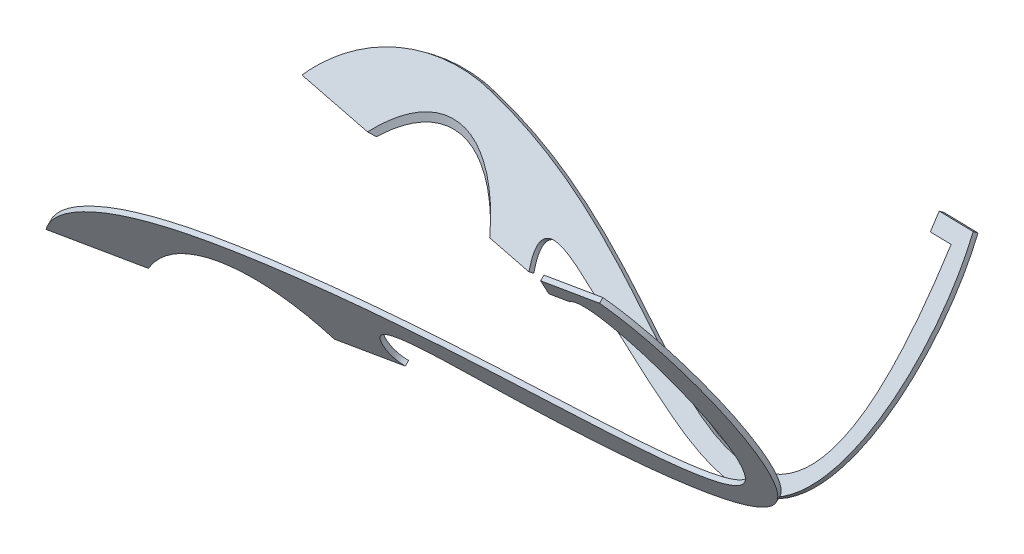
ISO-10303-21;
HEADER;
FILE_DESCRIPTION(('STEP AP214'),'2;1');
FILE_NAME('part.step','',(''),(''),'','','');
FILE_SCHEMA(('AUTOMOTIVE_DESIGN { 1 0 10303 214 1 1 1 1 }'));
ENDSEC;
DATA;
#1=APPLICATION_CONTEXT('core data for automotive mechanical design processes');
#2=APPLICATION_PROTOCOL_DEFINITION('international standard','automotive_design',2000,#1);
#3=PRODUCT_CONTEXT('',#1,'mechanical');
#4=PRODUCT('Part','Part','',(#3));
#5=PRODUCT_RELATED_PRODUCT_CATEGORY('part','',(#4));
#6=PRODUCT_DEFINITION_FORMATION('','',#4);
#7=PRODUCT_DEFINITION_CONTEXT('part definition',#1,'design');
#8=PRODUCT_DEFINITION('design','',#6,#7);
#9=PRODUCT_DEFINITION_SHAPE('','',#8);
#10=(LENGTH_UNIT() NAMED_UNIT(*) SI_UNIT(.MILLI.,.METRE.));
#11=(NAMED_UNIT(*) PLANE_ANGLE_UNIT() SI_UNIT($,.RADIAN.));
#12=(NAMED_UNIT(*) SI_UNIT($,.STERADIAN.) SOLID_ANGLE_UNIT());
#13=UNCERTAINTY_MEASURE_WITH_UNIT(LENGTH_MEASURE(1.E-05),#10,'distance_accuracy_value','');
#14=(GEOMETRIC_REPRESENTATION_CONTEXT(3) GLOBAL_UNCERTAINTY_ASSIGNED_CONTEXT((#13)) GLOBAL_UNIT_ASSIGNED_CONTEXT((#10,
#11,#12)) REPRESENTATION_CONTEXT('',''));
#15=CARTESIAN_POINT('',(0.,0.,0.));
#16=DIRECTION('',(0.,0.,1.));
#17=DIRECTION('',(1.,0.,0.));
#18=AXIS2_PLACEMENT_3D('',#15,#16,#17);
#19=CARTESIAN_POINT('',(-126.890243985277,-4.70312074669387,222.992271828305));
#20=DIRECTION('',(0.0946498601323054,0.882500171342859,0.46068953923088));
#21=DIRECTION('',(0.,-0.462767074283753,0.886479912326758));
#22=AXIS2_PLACEMENT_3D('',#19,#20,#21);
#23=PLANE('',#22);
#24=DIRECTION('',(0.979540105481506,0.,-0.201249054043191));
#25=VECTOR('',#24,1.);
#26=CARTESIAN_POINT('',(-128.666267232034,0.,214.347828719058));
#27=LINE('',#26,#25);
#28=CARTESIAN_POINT('',(-290.690687625136,0.,247.636165922954));
#29=VERTEX_POINT('',#28);
#30=CARTESIAN_POINT('',(-128.666267232034,0.,214.347828719058));
#31=VERTEX_POINT('',#30);
#32=EDGE_CURVE('E94',#29,#31,#27,.T.);
#33=ORIENTED_EDGE('',*,*,#32,.T.);
#34=CARTESIAN_POINT('',(0.,98.095797668499,0.));
#35=DIRECTION('',(0.0946498601323054,0.882500171342859,0.46068953923088));
#36=DIRECTION('',(-0.177602324675704,0.47031207466939,-0.864444310924631));
#37=AXIS2_PLACEMENT_3D('',#34,#35,#36);
#38=ELLIPSE('',#37,283.28606397842,250.);
#39=CARTESIAN_POINT('',(-116.961656442491,-4.70312074669387,220.952417778645));
#40=VERTEX_POINT('',#39);
#41=EDGE_CURVE('E59',#31,#40,#38,.T.);
#42=ORIENTED_EDGE('',*,*,#41,.T.);
#43=DIRECTION('',(0.979540105481506,0.,-0.201249054043191));
#44=VECTOR('',#43,1.);
#45=CARTESIAN_POINT('',(-126.890243985277,-4.70312074669387,222.992271828305));
#46=LINE('',#45,#44);
#47=CARTESIAN_POINT('',(-288.914664378379,-4.70312074669394,256.2806090322));
#48=VERTEX_POINT('',#47);
#49=EDGE_CURVE('E172',#48,#40,#46,.T.);
#50=ORIENTED_EDGE('',*,*,#49,.F.);
#51=DIRECTION('',(-0.177602324675705,0.47031207466939,-0.864444310924631));
#52=VECTOR('',#51,1.);
#53=CARTESIAN_POINT('',(-288.914664378379,-4.70312074669394,256.2806090322));
#54=LINE('',#53,#52);
#55=EDGE_CURVE('E137',#48,#29,#54,.T.);
#56=ORIENTED_EDGE('',*,*,#55,.T.);
#57=EDGE_LOOP('',(#33,#42,#50,#56));
#58=FACE_BOUND('',#57,.T.);
#59=ADVANCED_FACE('F44',(#58),#23,.F.);
#60=CARTESIAN_POINT('',(194.600857594281,-4.70312074669379,156.941091571233));
#61=VERTEX_POINT('',#60);
#62=CARTESIAN_POINT('',(313.599347392111,-4.70312074669383,132.492543349096));
#63=VERTEX_POINT('',#62);
#64=EDGE_CURVE('E102',#61,#63,#46,.T.);
#65=ORIENTED_EDGE('',*,*,#64,.F.);
#66=CARTESIAN_POINT('',(202.753421890311,0.,146.256794412327));
#67=VERTEX_POINT('',#66);
#68=EDGE_CURVE('E180',#61,#67,#38,.T.);
#69=ORIENTED_EDGE('',*,*,#68,.T.);
#70=CARTESIAN_POINT('',(311.823324145354,0.,123.84810023985));
#71=VERTEX_POINT('',#70);
#72=EDGE_CURVE('E179',#67,#71,#27,.T.);
#73=ORIENTED_EDGE('',*,*,#72,.T.);
#74=DIRECTION('',(-0.177602324675705,0.47031207466939,-0.864444310924631));
#75=VECTOR('',#74,1.);
#76=CARTESIAN_POINT('',(313.599347392111,-4.70312074669383,132.492543349096));
#77=LINE('',#76,#75);
#78=EDGE_CURVE('E52',#63,#71,#77,.T.);
#79=ORIENTED_EDGE('',*,*,#78,.F.);
#80=EDGE_LOOP('',(#65,#69,#73,#79));
#81=FACE_BOUND('',#80,.T.);
#82=ADVANCED_FACE('F46',(#81),#23,.F.);
#83=CARTESIAN_POINT('',(313.599347392111,-4.70312074669385,132.492543349096));
#84=CARTESIAN_POINT('',(292.760489072689,5.13202945054136,142.124881106236));
#85=CARTESIAN_POINT('',(283.884343089574,114.718767101645,203.570586087379));
#86=CARTESIAN_POINT('',(605.809475240874,-29.1290002950087,59.1680003048838));
#87=CARTESIAN_POINT('',(1087.13537008227,-117.314227495178,-87.6999626230578));
#88=CARTESIAN_POINT('',(933.765188382121,352.555347713641,199.4489403304));
#89=CARTESIAN_POINT('',(836.303003600073,431.884725446082,262.632969791383));
#90=B_SPLINE_CURVE_WITH_KNOTS('',3,(#83,#84,#85,#86,#87,#88,#89),.UNSPECIFIED.,.F.,.F.,(4,1,1,1,
4),(0.,0.0586117794744246,0.210635662863056,0.589849873863333,1.),.UNSPECIFIED.);
#91=DIRECTION('',(-0.177602324675705,0.47031207466939,-0.864444310924631));
#92=VECTOR('',#91,1.);
#93=SURFACE_OF_LINEAR_EXTRUSION('',#90,#92);
#94=CARTESIAN_POINT('',(311.823324145354,0.,123.84810023985));
#95=CARTESIAN_POINT('',(290.984465825932,9.83515019723526,133.48043799699));
#96=CARTESIAN_POINT('',(282.108319842817,119.421887848339,194.926142978133));
#97=CARTESIAN_POINT('',(604.033451994117,-24.4258795483148,50.5235571956375));
#98=CARTESIAN_POINT('',(1085.35934683551,-112.611106748484,-96.3444057323042));
#99=CARTESIAN_POINT('',(931.989165135364,357.258468460335,190.804497221154));
#100=CARTESIAN_POINT('',(834.526980353316,436.587846192776,253.988526682137));
#101=B_SPLINE_CURVE_WITH_KNOTS('',3,(#94,#95,#96,#97,#98,#99,#100),.UNSPECIFIED.,.F.,.F.,(4,1,1,
1,4),(0.,0.0586117794744246,0.210635662863056,0.589849873863333,1.),.UNSPECIFIED.);
#102=CARTESIAN_POINT('',(834.526980353316,436.587846192776,253.988526682137));
#103=VERTEX_POINT('',#102);
#104=EDGE_CURVE('E210',#71,#103,#101,.T.);
#105=ORIENTED_EDGE('',*,*,#104,.T.);
#106=DIRECTION('',(-0.177602324675705,0.47031207466939,-0.864444310924631));
#107=VECTOR('',#106,1.);
#108=CARTESIAN_POINT('',(836.303003600073,431.884725446082,262.632969791383));
#109=LINE('',#108,#107);
#110=CARTESIAN_POINT('',(836.303003600073,431.884725446082,262.632969791383));
#111=VERTEX_POINT('',#110);
#112=EDGE_CURVE('E206',#111,#103,#109,.T.);
#113=ORIENTED_EDGE('',*,*,#112,.F.);
#114=EDGE_CURVE('E167',#63,#111,#90,.T.);
#115=ORIENTED_EDGE('',*,*,#114,.F.);
#116=ORIENTED_EDGE('',*,*,#78,.T.);
#117=EDGE_LOOP('',(#105,#113,#115,#116));
#118=FACE_BOUND('',#117,.T.);
#119=ADVANCED_FACE('F162',(#118),#93,.F.);
#120=CARTESIAN_POINT('',(737.48161955563,431.884725446082,282.936079329106));
#121=DIRECTION('',(-0.0946498601323044,-0.882500171342859,-0.46068953923088));
#122=DIRECTION('',(0.,0.462767074283753,-0.886479912326757));
#123=AXIS2_PLACEMENT_3D('',#120,#121,#122);
#124=PLANE('',#123);
#125=DIRECTION('',(-0.979540105481506,0.,0.201249054043191));
#126=VECTOR('',#125,1.);
#127=CARTESIAN_POINT('',(735.705596308873,436.587846192776,274.291636219859));
#128=LINE('',#127,#126);
#129=CARTESIAN_POINT('',(735.705596308873,436.587846192776,274.291636219859));
#130=VERTEX_POINT('',#129);
#131=EDGE_CURVE('E212',#103,#130,#128,.T.);
#132=ORIENTED_EDGE('',*,*,#131,.T.);
#133=DIRECTION('',(-0.177602324675705,0.47031207466939,-0.864444310924631));
#134=VECTOR('',#133,1.);
#135=CARTESIAN_POINT('',(737.48161955563,431.884725446082,282.936079329106));
#136=LINE('',#135,#134);
#137=CARTESIAN_POINT('',(737.48161955563,431.884725446082,282.936079329106));
#138=VERTEX_POINT('',#137);
#139=EDGE_CURVE('E131',#138,#130,#136,.T.);
#140=ORIENTED_EDGE('',*,*,#139,.F.);
#141=DIRECTION('',(-0.979540105481506,0.,0.201249054043191));
#142=VECTOR('',#141,1.);
#143=CARTESIAN_POINT('',(737.48161955563,431.884725446082,282.936079329106));
#144=LINE('',#143,#142);
#145=EDGE_CURVE('E119',#111,#138,#144,.T.);
#146=ORIENTED_EDGE('',*,*,#145,.F.);
#147=ORIENTED_EDGE('',*,*,#112,.T.);
#148=EDGE_LOOP('',(#132,#140,#146,#147));
#149=FACE_BOUND('',#148,.T.);
#150=ADVANCED_FACE('F160',(#149),#124,.F.);
#151=CARTESIAN_POINT('',(737.087506644061,400.296879253306,265.831275791019));
#152=DIRECTION('',(0.984041186116776,0.0750800821817315,-0.161325525833552));
#153=DIRECTION('',(-0.161782154768596,0.,-0.986826496603344));
#154=AXIS2_PLACEMENT_3D('',#151,#152,#153);
#155=PLANE('',#154);
#156=DIRECTION('',(-0.0109707928461565,-0.879300593471743,-0.476140848935026));
#157=VECTOR('',#156,1.);
#158=CARTESIAN_POINT('',(735.311483397304,405.,257.186832681773));
#159=LINE('',#158,#157);
#160=CARTESIAN_POINT('',(735.311483397304,405.,257.186832681773));
#161=VERTEX_POINT('',#160);
#162=EDGE_CURVE('E128',#130,#161,#159,.T.);
#163=ORIENTED_EDGE('',*,*,#162,.T.);
#164=DIRECTION('',(-0.177602324675705,0.47031207466939,-0.864444310924631));
#165=VECTOR('',#164,1.);
#166=CARTESIAN_POINT('',(737.087506644061,400.296879253306,265.831275791019));
#167=LINE('',#166,#165);
#168=CARTESIAN_POINT('',(737.087506644061,400.296879253306,265.831275791019));
#169=VERTEX_POINT('',#168);
#170=EDGE_CURVE('E125',#169,#161,#167,.T.);
#171=ORIENTED_EDGE('',*,*,#170,.F.);
#172=DIRECTION('',(-0.0109707928461565,-0.879300593471743,-0.476140848935026));
#173=VECTOR('',#172,1.);
#174=CARTESIAN_POINT('',(737.087506644061,400.296879253306,265.831275791019));
#175=LINE('',#174,#173);
#176=EDGE_CURVE('E112',#138,#169,#175,.T.);
#177=ORIENTED_EDGE('',*,*,#176,.F.);
#178=ORIENTED_EDGE('',*,*,#139,.T.);
#179=EDGE_LOOP('',(#163,#171,#177,#178));
#180=FACE_BOUND('',#179,.T.);
#181=ADVANCED_FACE('F126',(#180),#155,.F.);
#182=CARTESIAN_POINT('',(772.067998237677,400.296879253306,258.644443109247));
#183=DIRECTION('',(0.0946498601323037,0.882500171342859,0.46068953923088));
#184=DIRECTION('',(0.,-0.462767074283753,0.886479912326757));
#185=AXIS2_PLACEMENT_3D('',#182,#183,#184);
#186=PLANE('',#185);
#187=DIRECTION('',(0.979540105481506,0.,-0.201249054043191));
#188=VECTOR('',#187,1.);
#189=CARTESIAN_POINT('',(770.29197499092,405.,250.));
#190=LINE('',#189,#188);
#191=CARTESIAN_POINT('',(770.29197499092,405.,250.));
#192=VERTEX_POINT('',#191);
#193=EDGE_CURVE('E193',#161,#192,#190,.T.);
#194=ORIENTED_EDGE('',*,*,#193,.T.);
#195=DIRECTION('',(-0.177602324675705,0.47031207466939,-0.864444310924631));
#196=VECTOR('',#195,1.);
#197=CARTESIAN_POINT('',(772.067998237677,400.296879253306,258.644443109247));
#198=LINE('',#197,#196);
#199=CARTESIAN_POINT('',(772.067998237677,400.296879253306,258.644443109247));
#200=VERTEX_POINT('',#199);
#201=EDGE_CURVE('E132',#200,#192,#198,.T.);
#202=ORIENTED_EDGE('',*,*,#201,.F.);
#203=DIRECTION('',(0.979540105481506,0.,-0.201249054043191));
#204=VECTOR('',#203,1.);
#205=CARTESIAN_POINT('',(772.067998237677,400.296879253306,258.644443109247));
#206=LINE('',#205,#204);
#207=EDGE_CURVE('E116',#169,#200,#206,.T.);
#208=ORIENTED_EDGE('',*,*,#207,.F.);
#209=ORIENTED_EDGE('',*,*,#170,.T.);
#210=EDGE_LOOP('',(#194,#202,#208,#209));
#211=FACE_BOUND('',#210,.T.);
#212=ADVANCED_FACE('F134',(#211),#186,.F.);
#213=CARTESIAN_POINT('',(772.067998237677,400.296879253306,258.644443109247));
#214=CARTESIAN_POINT('',(831.610634219452,445.907051835621,271.226056740206));
#215=CARTESIAN_POINT('',(1063.74954188229,-95.8336054810433,-71.208474186757));
#216=CARTESIAN_POINT('',(541.802504552001,70.0337235607499,126.269157017014));
#217=CARTESIAN_POINT('',(333.644707424646,129.953287435007,201.635727477166));
#218=CARTESIAN_POINT('',(89.559083847973,159.679009143172,267.956413830491));
#219=CARTESIAN_POINT('',(-117.764119047549,148.059682691688,304.229858941443));
#220=CARTESIAN_POINT('',(-253.36702969668,56.028060403311,282.018837587133));
#221=CARTESIAN_POINT('',(-288.914664378379,-4.70312074669394,256.2806090322));
#222=B_SPLINE_CURVE_WITH_KNOTS('',3,(#213,#214,#215,#216,#217,#218,#219,#220,#221),
.UNSPECIFIED.,.F.,.F.,(4,1,1,1,1,1,4),(0.,0.264931709853119,0.446951445466688,0.650679216171731,
0.734263071655086,0.875146293286584,1.),.UNSPECIFIED.);
#223=DIRECTION('',(-0.177602324675705,0.47031207466939,-0.864444310924631));
#224=VECTOR('',#223,1.);
#225=SURFACE_OF_LINEAR_EXTRUSION('',#222,#224);
#226=CARTESIAN_POINT('',(770.29197499092,405.,250.));
#227=CARTESIAN_POINT('',(829.834610972695,450.610172582315,262.58161363096));
#228=CARTESIAN_POINT('',(1061.97351863553,-91.1304847343494,-79.8529172960033));
#229=CARTESIAN_POINT('',(540.026481305244,74.7368443074438,117.624713907768));
#230=CARTESIAN_POINT('',(331.868684177889,134.656408181701,192.99128436792));
#231=CARTESIAN_POINT('',(87.783060601216,164.382129889866,259.311970721244));
#232=CARTESIAN_POINT('',(-119.540142294306,152.762803438382,295.585415832196));
#233=CARTESIAN_POINT('',(-255.143052943437,60.7311811500049,273.374394477886));
#234=CARTESIAN_POINT('',(-290.690687625136,0.,247.636165922954));
#235=B_SPLINE_CURVE_WITH_KNOTS('',3,(#226,#227,#228,#229,#230,#231,#232,#233,#234),
.UNSPECIFIED.,.F.,.F.,(4,1,1,1,1,1,4),(0.,0.264931709853119,0.446951445466688,0.650679216171731,
0.734263071655086,0.875146293286584,1.),.UNSPECIFIED.);
#236=EDGE_CURVE('E192',#192,#29,#235,.T.);
#237=ORIENTED_EDGE('',*,*,#236,.T.);
#238=ORIENTED_EDGE('',*,*,#55,.F.);
#239=EDGE_CURVE('E67',#200,#48,#222,.T.);
#240=ORIENTED_EDGE('',*,*,#239,.F.);
#241=ORIENTED_EDGE('',*,*,#201,.T.);
#242=EDGE_LOOP('',(#237,#238,#240,#241));
#243=FACE_BOUND('',#242,.T.);
#244=ADVANCED_FACE('F149',(#243),#225,.F.);
#245=CARTESIAN_POINT('',(496.135644750088,81.8926682058061,142.103543510025));
#246=DIRECTION('',(0.177602324675705,-0.47031207466939,0.864444310924631));
#247=DIRECTION('',(0.,-0.878408958478234,-0.477909721249928));
#248=AXIS2_PLACEMENT_3D('',#245,#246,#247);
#249=PLANE('',#248);
#250=CARTESIAN_POINT('',(0.,-366.650873356167,0.));
#251=DIRECTION('',(0.177602324675705,-0.47031207466939,0.864444310924631));
#252=DIRECTION('',(0.094649860132306,0.882500171342858,0.46068953923088));
#253=AXIS2_PLACEMENT_3D('',#250,#251,#252);
#254=ELLIPSE('',#253,531.561942516019,250.);
#255=EDGE_CURVE('E177',#61,#40,#254,.T.);
#256=ORIENTED_EDGE('',*,*,#255,.F.);
#257=ORIENTED_EDGE('',*,*,#64,.T.);
#258=ORIENTED_EDGE('',*,*,#114,.T.);
#259=ORIENTED_EDGE('',*,*,#145,.T.);
#260=ORIENTED_EDGE('',*,*,#176,.T.);
#261=ORIENTED_EDGE('',*,*,#207,.T.);
#262=ORIENTED_EDGE('',*,*,#239,.T.);
#263=ORIENTED_EDGE('',*,*,#49,.T.);
#264=EDGE_LOOP('',(#256,#257,#258,#259,#260,#261,#262,#263));
#265=FACE_BOUND('',#264,.T.);
#266=ADVANCED_FACE('F114',(#265),#249,.T.);
#267=CARTESIAN_POINT('',(494.359621503331,86.5957889524999,133.459100400779));
#268=DIRECTION('',(0.177602324675705,-0.47031207466939,0.864444310924631));
#269=DIRECTION('',(0.,-0.878408958478234,-0.477909721249928));
#270=AXIS2_PLACEMENT_3D('',#267,#268,#269);
#271=PLANE('',#270);
#272=ORIENTED_EDGE('',*,*,#72,.F.);
#273=CARTESIAN_POINT('',(0.,-345.388395655526,0.));
#274=DIRECTION('',(0.177602324675705,-0.47031207466939,0.864444310924631));
#275=DIRECTION('',(0.094649860132306,0.882500171342858,0.46068953923088));
#276=AXIS2_PLACEMENT_3D('',#273,#274,#275);
#277=ELLIPSE('',#276,531.561942516019,250.);
#278=EDGE_CURVE('E13',#67,#31,#277,.T.);
#279=ORIENTED_EDGE('',*,*,#278,.T.);
#280=ORIENTED_EDGE('',*,*,#32,.F.);
#281=ORIENTED_EDGE('',*,*,#236,.F.);
#282=ORIENTED_EDGE('',*,*,#193,.F.);
#283=ORIENTED_EDGE('',*,*,#162,.F.);
#284=ORIENTED_EDGE('',*,*,#131,.F.);
#285=ORIENTED_EDGE('',*,*,#104,.F.);
#286=EDGE_LOOP('',(#272,#279,#280,#281,#282,#283,#284,#285));
#287=FACE_BOUND('',#286,.T.);
#288=ADVANCED_FACE('F154',(#287),#271,.F.);
#289=CARTESIAN_POINT('',(0.,-500.,0.));
#290=DIRECTION('',(0.,1.,0.));
#291=DIRECTION('',(0.,0.,1.));
#292=AXIS2_PLACEMENT_3D('',#289,#290,#291);
#293=CYLINDRICAL_SURFACE('',#292,250.);
#294=ORIENTED_EDGE('',*,*,#255,.T.);
#295=ORIENTED_EDGE('',*,*,#41,.F.);
#296=ORIENTED_EDGE('',*,*,#278,.F.);
#297=ORIENTED_EDGE('',*,*,#68,.F.);
#298=EDGE_LOOP('',(#294,#295,#296,#297));
#299=FACE_BOUND('',#298,.T.);
#300=ADVANCED_FACE('F220',(#299),#293,.F.);
#301=CLOSED_SHELL('',(#59,#82,#119,#150,#181,#212,#244,#266,#288,#300));
#302=MANIFOLD_SOLID_BREP('B2',#301);
#303=CARTESIAN_POINT('',(-281.108307604903,7.4282951740583,-263.121520086881));
#304=DIRECTION('',(-0.109137915703114,-0.828313622736365,0.549532035231195));
#305=DIRECTION('',(0.,-0.552834326383907,-0.833291190144028));
#306=AXIS2_PLACEMENT_3D('',#303,#304,#305);
#307=PLANE('',#306);
#308=CARTESIAN_POINT('',(0.,144.953655787253,0.));
#309=DIRECTION('',(-0.109137915703114,-0.828313622736365,0.549532035231195));
#310=DIRECTION('',(-0.161353055324413,0.560264707427979,0.812446089994972));
#311=AXIS2_PLACEMENT_3D('',#308,#309,#310);
#312=ELLIPSE('',#311,301.818047099257,250.);
#313=CARTESIAN_POINT('',(-116.489273284422,13.5492071798678,-221.201829128213));
#314=VERTEX_POINT('',#313);
#315=CARTESIAN_POINT('',(-104.341223793399,7.97931504673864,-227.184746445037));
#316=VERTEX_POINT('',#315);
#317=EDGE_CURVE('E42',#314,#316,#312,.T.);
#318=ORIENTED_EDGE('',*,*,#317,.F.);
#319=DIRECTION('',(0.979949252049253,0.00305470622954426,0.199223824323201));
#320=VECTOR('',#319,1.);
#321=CARTESIAN_POINT('',(-282.775292270822,13.0308589725278,-255.007800778963));
#322=LINE('',#321,#320);
#323=CARTESIAN_POINT('',(-282.775292270822,13.0308589725278,-255.007800778963));
#324=VERTEX_POINT('',#323);
#325=EDGE_CURVE('E385',#324,#314,#322,.T.);
#326=ORIENTED_EDGE('',*,*,#325,.F.);
#327=DIRECTION('',(-0.166698466591898,0.56025637984695,0.81137193079173));
#328=VECTOR('',#327,1.);
#329=CARTESIAN_POINT('',(-281.108307604903,7.4282951740583,-263.121520086881));
#330=LINE('',#329,#328);
#331=CARTESIAN_POINT('',(-281.108307604903,7.4282951740583,-263.121520086881));
#332=VERTEX_POINT('',#331);
#333=EDGE_CURVE('E400',#332,#324,#330,.T.);
#334=ORIENTED_EDGE('',*,*,#333,.F.);
#335=DIRECTION('',(0.979949252049253,0.00305470622954426,0.199223824323201));
#336=VECTOR('',#335,1.);
#337=CARTESIAN_POINT('',(-281.108307604903,7.4282951740583,-263.121520086881));
#338=LINE('',#337,#336);
#339=EDGE_CURVE('E413',#332,#316,#338,.T.);
#340=ORIENTED_EDGE('',*,*,#339,.T.);
#341=EDGE_LOOP('',(#318,#326,#334,#340));
#342=FACE_BOUND('',#341,.T.);
#343=ADVANCED_FACE('F296',(#342),#307,.T.);
#344=CARTESIAN_POINT('',(861.796994733196,134.716396468939,-116.201733973342));
#345=DIRECTION('',(-0.131241553500025,-0.828171343160427,0.544892540784652));
#346=DIRECTION('',(0.,-0.549646754525796,-0.835397178136998));
#347=AXIS2_PLACEMENT_3D('',#344,#345,#346);
#348=PLANE('',#347);
#349=DIRECTION('',(-0.166698466591898,0.56025637984695,0.81137193079173));
#350=VECTOR('',#349,1.);
#351=CARTESIAN_POINT('',(76.4243397501527,147.296189757433,-286.244992188213));
#352=LINE('',#351,#350);
#353=CARTESIAN_POINT('',(76.4243397400589,147.296189757677,-286.244992190455));
#354=VERTEX_POINT('',#353);
#355=CARTESIAN_POINT('',(74.7573550741478,152.898753556146,-278.131272882536));
#356=VERTEX_POINT('',#355);
#357=EDGE_CURVE('E399',#354,#356,#352,.T.);
#358=ORIENTED_EDGE('',*,*,#357,.F.);
#359=DIRECTION('',(0.977234504032072,-0.0156529616572566,0.21158381062961));
#360=VECTOR('',#359,1.);
#361=CARTESIAN_POINT('',(861.796994733196,134.716396468939,-116.201733973342));
#362=LINE('',#361,#360);
#363=CARTESIAN_POINT('',(51.0310654698198,147.702929334292,-291.742961932862));
#364=VERTEX_POINT('',#363);
#365=EDGE_CURVE('E376',#364,#354,#362,.T.);
#366=ORIENTED_EDGE('',*,*,#365,.F.);
#367=DIRECTION('',(-0.166698466591898,0.56025637984695,0.81137193079173));
#368=VECTOR('',#367,1.);
#369=CARTESIAN_POINT('',(51.0310654698198,147.702929334292,-291.742961932862));
#370=LINE('',#369,#368);
#371=CARTESIAN_POINT('',(49.3640808039008,153.305493132762,-283.629242624945));
#372=VERTEX_POINT('',#371);
#373=EDGE_CURVE('E402',#364,#372,#370,.T.);
#374=ORIENTED_EDGE('',*,*,#373,.T.);
#375=DIRECTION('',(0.977234504032072,-0.0156529616572566,0.21158381062961));
#376=VECTOR('',#375,1.);
#377=CARTESIAN_POINT('',(860.130010067277,140.318960267408,-108.088014665425));
#378=LINE('',#377,#376);
#379=EDGE_CURVE('E415',#372,#356,#378,.T.);
#380=ORIENTED_EDGE('',*,*,#379,.T.);
#381=EDGE_LOOP('',(#358,#366,#374,#380));
#382=FACE_BOUND('',#381,.T.);
#383=ADVANCED_FACE('F298',(#382),#348,.F.);
#384=CARTESIAN_POINT('',(-285.799227551132,-34.7276674028163,-234.976378563365));
#385=DIRECTION('',(-0.166698466591898,0.56025637984695,0.81137193079173));
#386=DIRECTION('',(0.,-0.822885813703978,0.568206773635041));
#387=AXIS2_PLACEMENT_3D('',#384,#385,#386);
#388=PLANE('',#387);
#389=CARTESIAN_POINT('',(184.765550025301,8.88052116648477,-168.40929761699));
#390=VERTEX_POINT('',#389);
#391=CARTESIAN_POINT('',(294.640061971963,9.2230229393161,-146.071793486155));
#392=VERTEX_POINT('',#391);
#393=EDGE_CURVE('E448',#390,#392,#338,.T.);
#394=ORIENTED_EDGE('',*,*,#393,.F.);
#395=CARTESIAN_POINT('',(0.,-289.987491518608,0.));
#396=DIRECTION('',(-0.166698466591898,0.56025637984695,0.81137193079173));
#397=DIRECTION('',(0.112751066465862,0.828319255384535,-0.548793593411968));
#398=AXIS2_PLACEMENT_3D('',#395,#396,#397);
#399=ELLIPSE('',#398,446.224280512958,250.);
#400=EDGE_CURVE('E310',#390,#316,#399,.T.);
#401=ORIENTED_EDGE('',*,*,#400,.T.);
#402=ORIENTED_EDGE('',*,*,#339,.F.);
#403=CARTESIAN_POINT('',(27.0830568158535,-91.0233649838312,-131.821441130696));
#404=DIRECTION('',(-0.166698466591898,0.56025637984695,0.81137193079173));
#405=DIRECTION('',(-0.982503648695653,-0.0250675844724059,-0.184548629115602));
#406=AXIS2_PLACEMENT_3D('',#403,#404,#405);
#407=ELLIPSE('',#406,362.724213179992,288.33772478299);
#408=EDGE_CURVE('E449',#364,#332,#407,.T.);
#409=ORIENTED_EDGE('',*,*,#408,.F.);
#410=ORIENTED_EDGE('',*,*,#365,.T.);
#411=CARTESIAN_POINT('',(1045.44440879413,381.268404004995,-248.716292079523));
#412=CARTESIAN_POINT('',(1065.84289814074,-134.763102776848,111.796969065714));
#413=CARTESIAN_POINT('',(581.785853782238,79.0042239683642,-135.261214785677));
#414=CARTESIAN_POINT('',(203.062639605187,146.495957349245,-259.674260700558));
#415=CARTESIAN_POINT('',(51.0310654698197,147.702929334292,-291.742961932862));
#416=B_SPLINE_CURVE_WITH_KNOTS('',3,(#411,#412,#413,#414,#415),.UNSPECIFIED.,.F.,.F.,(4,1,4),
(0.,0.66229929311418,1.),.UNSPECIFIED.);
#417=CARTESIAN_POINT('',(1045.44440879413,381.268404004995,-248.716292079523));
#418=VERTEX_POINT('',#417);
#419=EDGE_CURVE('E453',#418,#354,#416,.T.);
#420=ORIENTED_EDGE('',*,*,#419,.F.);
#421=DIRECTION('',(0.985869295508668,0.108504048686864,0.127626813764984));
#422=VECTOR('',#421,1.);
#423=CARTESIAN_POINT('',(1045.44440879413,381.268404004995,-248.716292079523));
#424=LINE('',#423,#422);
#425=CARTESIAN_POINT('',(997.138166564544,375.951854557075,-254.969830767468));
#426=VERTEX_POINT('',#425);
#427=EDGE_CURVE('E499',#426,#418,#424,.T.);
#428=ORIENTED_EDGE('',*,*,#427,.F.);
#429=DIRECTION('',(0.0165334028304097,-0.821181867955782,0.570427021039063));
#430=VECTOR('',#429,1.);
#431=CARTESIAN_POINT('',(997.138166564544,375.951854557075,-254.969830767468));
#432=LINE('',#431,#430);
#433=CARTESIAN_POINT('',(996.598456648279,402.758193320975,-273.59062667486));
#434=VERTEX_POINT('',#433);
#435=EDGE_CURVE('E497',#434,#426,#432,.T.);
#436=ORIENTED_EDGE('',*,*,#435,.F.);
#437=DIRECTION('',(-0.985869295508668,-0.108504048686863,-0.127626813764984));
#438=VECTOR('',#437,1.);
#439=CARTESIAN_POINT('',(996.59845664828,402.758193320975,-273.59062667486));
#440=LINE('',#439,#438);
#441=CARTESIAN_POINT('',(1075.36485099009,411.427164680046,-263.39383488167));
#442=VERTEX_POINT('',#441);
#443=EDGE_CURVE('E491',#442,#434,#440,.T.);
#444=ORIENTED_EDGE('',*,*,#443,.F.);
#445=CARTESIAN_POINT('',(294.640061971963,9.2230229393161,-146.071793486155));
#446=CARTESIAN_POINT('',(264.464704328707,77.3070541861719,-199.283763337778));
#447=CARTESIAN_POINT('',(464.713684793131,36.3634073118402,-129.870298047453));
#448=CARTESIAN_POINT('',(629.640350323183,-3.36441136891395,-68.5534293843687));
#449=CARTESIAN_POINT('',(1039.31132515414,-68.8531176503756,60.834813947146));
#450=CARTESIAN_POINT('',(1106.16382410101,280.215745006164,-166.463963898184));
#451=CARTESIAN_POINT('',(1075.36485099009,411.427164680046,-263.39383488167));
#452=B_SPLINE_CURVE_WITH_KNOTS('',3,(#445,#446,#447,#448,#449,#450,#451),.UNSPECIFIED.,.F.,.F.,
(4,1,1,1,4),(0.,0.133860157979823,0.347766727230296,0.574790643155983,1.),.UNSPECIFIED.);
#453=EDGE_CURVE('E393',#392,#442,#452,.T.);
#454=ORIENTED_EDGE('',*,*,#453,.F.);
#455=EDGE_LOOP('',(#394,#401,#402,#409,#410,#420,#428,#436,#444,#454));
#456=FACE_BOUND('',#455,.T.);
#457=ADVANCED_FACE('F484',(#456),#388,.F.);
#458=CARTESIAN_POINT('',(-287.466212217051,-29.1251036043468,-226.862659255448));
#459=DIRECTION('',(-0.166698466591898,0.56025637984695,0.81137193079173));
#460=DIRECTION('',(0.,-0.822885813703978,0.568206773635041));
#461=AXIS2_PLACEMENT_3D('',#458,#459,#460);
#462=PLANE('',#461);
#463=CARTESIAN_POINT('',(0.,-272.13852029809,0.));
#464=DIRECTION('',(-0.166698466591898,0.56025637984695,0.81137193079173));
#465=DIRECTION('',(0.112751066465862,0.828319255384535,-0.548793593411968));
#466=AXIS2_PLACEMENT_3D('',#463,#464,#465);
#467=ELLIPSE('',#466,446.224280512958,250.);
#468=CARTESIAN_POINT('',(193.61317256607,14.5158611888948,-158.157957146965));
#469=VERTEX_POINT('',#468);
#470=EDGE_CURVE('E371',#469,#314,#467,.T.);
#471=ORIENTED_EDGE('',*,*,#470,.F.);
#472=CARTESIAN_POINT('',(292.973077306044,14.8255867377856,-137.958074178238));
#473=VERTEX_POINT('',#472);
#474=EDGE_CURVE('E381',#469,#473,#322,.T.);
#475=ORIENTED_EDGE('',*,*,#474,.T.);
#476=CARTESIAN_POINT('',(292.973077306044,14.8255867377856,-137.958074178238));
#477=CARTESIAN_POINT('',(262.797719662788,82.9096179846414,-191.170044029861));
#478=CARTESIAN_POINT('',(463.046700127212,41.9659711103097,-121.756578739536));
#479=CARTESIAN_POINT('',(627.973365657265,2.23815242955555,-60.4397100764514));
#480=CARTESIAN_POINT('',(1037.64434048822,-63.2505538519061,68.9485332550633));
#481=CARTESIAN_POINT('',(1104.49683943509,285.818308804634,-158.350244590266));
#482=CARTESIAN_POINT('',(1073.69786632417,417.029728478515,-255.280115573753));
#483=B_SPLINE_CURVE_WITH_KNOTS('',3,(#476,#477,#478,#479,#480,#481,#482),.UNSPECIFIED.,.F.,.F.,
(4,1,1,1,4),(0.,0.133860157979823,0.347766727230296,0.574790643155983,1.),.UNSPECIFIED.);
#484=CARTESIAN_POINT('',(1073.69786632417,417.029728478515,-255.280115573753));
#485=VERTEX_POINT('',#484);
#486=EDGE_CURVE('E439',#473,#485,#483,.T.);
#487=ORIENTED_EDGE('',*,*,#486,.T.);
#488=DIRECTION('',(-0.985869295508668,-0.108504048686863,-0.127626813764984));
#489=VECTOR('',#488,1.);
#490=CARTESIAN_POINT('',(994.931471982361,408.360757119444,-265.476907366943));
#491=LINE('',#490,#489);
#492=CARTESIAN_POINT('',(994.931471982361,408.360757119445,-265.476907366943));
#493=VERTEX_POINT('',#492);
#494=EDGE_CURVE('E436',#485,#493,#491,.T.);
#495=ORIENTED_EDGE('',*,*,#494,.T.);
#496=DIRECTION('',(0.0165334028304097,-0.821181867955782,0.570427021039063));
#497=VECTOR('',#496,1.);
#498=CARTESIAN_POINT('',(995.471181898625,381.554418355545,-246.856111459551));
#499=LINE('',#498,#497);
#500=CARTESIAN_POINT('',(995.471181898625,381.554418355545,-246.856111459551));
#501=VERTEX_POINT('',#500);
#502=EDGE_CURVE('E318',#493,#501,#499,.T.);
#503=ORIENTED_EDGE('',*,*,#502,.T.);
#504=DIRECTION('',(0.985869295508668,0.108504048686864,0.127626813764984));
#505=VECTOR('',#504,1.);
#506=CARTESIAN_POINT('',(1043.77742412821,386.870967803465,-240.602572771606));
#507=LINE('',#506,#505);
#508=CARTESIAN_POINT('',(1043.77742412821,386.870967803465,-240.602572771606));
#509=VERTEX_POINT('',#508);
#510=EDGE_CURVE('E426',#501,#509,#507,.T.);
#511=ORIENTED_EDGE('',*,*,#510,.T.);
#512=CARTESIAN_POINT('',(1043.77742412821,386.870967803465,-240.602572771606));
#513=CARTESIAN_POINT('',(1064.17591347482,-129.160538978378,119.910688373632));
#514=CARTESIAN_POINT('',(580.118869116319,84.6067877668337,-127.14749547776));
#515=CARTESIAN_POINT('',(201.395654939268,152.098521147714,-251.560541392641));
#516=CARTESIAN_POINT('',(49.3640808039007,153.305493132761,-283.629242624945));
#517=B_SPLINE_CURVE_WITH_KNOTS('',3,(#512,#513,#514,#515,#516),.UNSPECIFIED.,.F.,.F.,(4,1,4),
(0.,0.66229929311418,1.),.UNSPECIFIED.);
#518=EDGE_CURVE('E394',#509,#356,#517,.T.);
#519=ORIENTED_EDGE('',*,*,#518,.T.);
#520=ORIENTED_EDGE('',*,*,#379,.F.);
#521=CARTESIAN_POINT('',(25.4160721499345,-85.4208011853617,-123.707721822778));
#522=DIRECTION('',(-0.166698466591898,0.56025637984695,0.81137193079173));
#523=DIRECTION('',(-0.982503648695653,-0.0250675844724059,-0.184548629115602));
#524=AXIS2_PLACEMENT_3D('',#521,#522,#523);
#525=ELLIPSE('',#524,362.724213179992,288.33772478299);
#526=EDGE_CURVE('E391',#372,#324,#525,.T.);
#527=ORIENTED_EDGE('',*,*,#526,.T.);
#528=ORIENTED_EDGE('',*,*,#325,.T.);
#529=EDGE_LOOP('',(#471,#475,#487,#495,#503,#511,#519,#520,#527,#528));
#530=FACE_BOUND('',#529,.T.);
#531=ADVANCED_FACE('F379',(#530),#462,.T.);
#532=DIRECTION('',(-0.166698466591898,0.56025637984695,0.81137193079173));
#533=VECTOR('',#532,1.);
#534=SURFACE_OF_LINEAR_EXTRUSION('',#416,#533);
#535=ORIENTED_EDGE('',*,*,#357,.T.);
#536=ORIENTED_EDGE('',*,*,#518,.F.);
#537=DIRECTION('',(-0.166698466591898,0.56025637984695,0.81137193079173));
#538=VECTOR('',#537,1.);
#539=CARTESIAN_POINT('',(1045.44440879413,381.268404004995,-248.716292079523));
#540=LINE('',#539,#538);
#541=EDGE_CURVE('E405',#418,#509,#540,.T.);
#542=ORIENTED_EDGE('',*,*,#541,.F.);
#543=ORIENTED_EDGE('',*,*,#419,.T.);
#544=EDGE_LOOP('',(#535,#536,#542,#543));
#545=FACE_BOUND('',#544,.T.);
#546=ADVANCED_FACE('F466',(#545),#534,.T.);
#547=DIRECTION('',(-0.166698466591898,0.56025637984695,0.81137193079173));
#548=VECTOR('',#547,1.);
#549=SURFACE_OF_LINEAR_EXTRUSION('',#452,#548);
#550=ORIENTED_EDGE('',*,*,#486,.F.);
#551=DIRECTION('',(-0.166698466591898,0.56025637984695,0.81137193079173));
#552=VECTOR('',#551,1.);
#553=CARTESIAN_POINT('',(294.640061971963,9.2230229393161,-146.071793486155));
#554=LINE('',#553,#552);
#555=EDGE_CURVE('E389',#392,#473,#554,.T.);
#556=ORIENTED_EDGE('',*,*,#555,.F.);
#557=ORIENTED_EDGE('',*,*,#453,.T.);
#558=DIRECTION('',(-0.166698466591898,0.56025637984695,0.81137193079173));
#559=VECTOR('',#558,1.);
#560=CARTESIAN_POINT('',(1075.36485099009,411.427164680046,-263.39383488167));
#561=LINE('',#560,#559);
#562=EDGE_CURVE('E411',#442,#485,#561,.T.);
#563=ORIENTED_EDGE('',*,*,#562,.T.);
#564=EDGE_LOOP('',(#550,#556,#557,#563));
#565=FACE_BOUND('',#564,.T.);
#566=ADVANCED_FACE('F469',(#565),#549,.T.);
#567=EDGE_CURVE('E300',#390,#469,#312,.T.);
#568=ORIENTED_EDGE('',*,*,#567,.F.);
#569=ORIENTED_EDGE('',*,*,#393,.T.);
#570=ORIENTED_EDGE('',*,*,#555,.T.);
#571=ORIENTED_EDGE('',*,*,#474,.F.);
#572=EDGE_LOOP('',(#568,#569,#570,#571));
#573=FACE_BOUND('',#572,.T.);
#574=ADVANCED_FACE('F387',(#573),#307,.T.);
#575=DIRECTION('',(-0.166698466591898,0.56025637984695,0.81137193079173));
#576=VECTOR('',#575,1.);
#577=SURFACE_OF_LINEAR_EXTRUSION('',#407,#576);
#578=ORIENTED_EDGE('',*,*,#526,.F.);
#579=ORIENTED_EDGE('',*,*,#373,.F.);
#580=ORIENTED_EDGE('',*,*,#408,.T.);
#581=ORIENTED_EDGE('',*,*,#333,.T.);
#582=EDGE_LOOP('',(#578,#579,#580,#581));
#583=FACE_BOUND('',#582,.T.);
#584=ADVANCED_FACE('F459',(#583),#577,.T.);
#585=CARTESIAN_POINT('',(1045.44440879413,381.268404004995,-248.716292079523));
#586=DIRECTION('',(0.0165334028304097,-0.821181867955783,0.570427021039062));
#587=DIRECTION('',(0.,-0.570505001111953,-0.821294127402754));
#588=AXIS2_PLACEMENT_3D('',#585,#586,#587);
#589=PLANE('',#588);
#590=ORIENTED_EDGE('',*,*,#510,.F.);
#591=DIRECTION('',(-0.166698466591898,0.56025637984695,0.81137193079173));
#592=VECTOR('',#591,1.);
#593=CARTESIAN_POINT('',(997.138166564544,375.951854557075,-254.969830767468));
#594=LINE('',#593,#592);
#595=EDGE_CURVE('E407',#426,#501,#594,.T.);
#596=ORIENTED_EDGE('',*,*,#595,.F.);
#597=ORIENTED_EDGE('',*,*,#427,.T.);
#598=ORIENTED_EDGE('',*,*,#541,.T.);
#599=EDGE_LOOP('',(#590,#596,#597,#598));
#600=FACE_BOUND('',#599,.T.);
#601=ADVANCED_FACE('F463',(#600),#589,.T.);
#602=CARTESIAN_POINT('',(997.138166564544,375.951854557075,-254.969830767468));
#603=DIRECTION('',(-0.985869295508668,-0.108504048686863,-0.127626813764983));
#604=DIRECTION('',(-0.128384796687515,0.,0.991724429455837));
#605=AXIS2_PLACEMENT_3D('',#602,#603,#604);
#606=PLANE('',#605);
#607=ORIENTED_EDGE('',*,*,#502,.F.);
#608=DIRECTION('',(-0.166698466591898,0.56025637984695,0.81137193079173));
#609=VECTOR('',#608,1.);
#610=CARTESIAN_POINT('',(996.59845664828,402.758193320975,-273.59062667486));
#611=LINE('',#610,#609);
#612=EDGE_CURVE('E409',#434,#493,#611,.T.);
#613=ORIENTED_EDGE('',*,*,#612,.F.);
#614=ORIENTED_EDGE('',*,*,#435,.T.);
#615=ORIENTED_EDGE('',*,*,#595,.T.);
#616=EDGE_LOOP('',(#607,#613,#614,#615));
#617=FACE_BOUND('',#616,.T.);
#618=ADVANCED_FACE('F472',(#617),#606,.T.);
#619=CARTESIAN_POINT('',(996.59845664828,402.758193320975,-273.59062667486));
#620=DIRECTION('',(-0.0165334028304091,0.821181867955783,-0.570427021039062));
#621=DIRECTION('',(0.,0.570505001111952,0.821294127402754));
#622=AXIS2_PLACEMENT_3D('',#619,#620,#621);
#623=PLANE('',#622);
#624=ORIENTED_EDGE('',*,*,#494,.F.);
#625=ORIENTED_EDGE('',*,*,#562,.F.);
#626=ORIENTED_EDGE('',*,*,#443,.T.);
#627=ORIENTED_EDGE('',*,*,#612,.T.);
#628=EDGE_LOOP('',(#624,#625,#626,#627));
#629=FACE_BOUND('',#628,.T.);
#630=ADVANCED_FACE('F476',(#629),#623,.T.);
#631=CARTESIAN_POINT('',(0.,-500.,0.));
#632=DIRECTION('',(0.,1.,0.));
#633=DIRECTION('',(0.,0.,1.));
#634=AXIS2_PLACEMENT_3D('',#631,#632,#633);
#635=CYLINDRICAL_SURFACE('',#634,250.);
#636=ORIENTED_EDGE('',*,*,#317,.T.);
#637=ORIENTED_EDGE('',*,*,#400,.F.);
#638=ORIENTED_EDGE('',*,*,#567,.T.);
#639=ORIENTED_EDGE('',*,*,#470,.T.);
#640=EDGE_LOOP('',(#636,#637,#638,#639));
#641=FACE_BOUND('',#640,.T.);
#642=ADVANCED_FACE('F370',(#641),#635,.F.);
#643=CLOSED_SHELL('',(#343,#383,#457,#531,#546,#566,#574,#584,#601,#618,#630,#642));
#644=MANIFOLD_SOLID_BREP('B7',#643);
#645=ADVANCED_BREP_SHAPE_REPRESENTATION('',(#18,#302,#644),#14);
#646=SHAPE_DEFINITION_REPRESENTATION(#9,#645);
ENDSEC;
END-ISO-10303-21;
